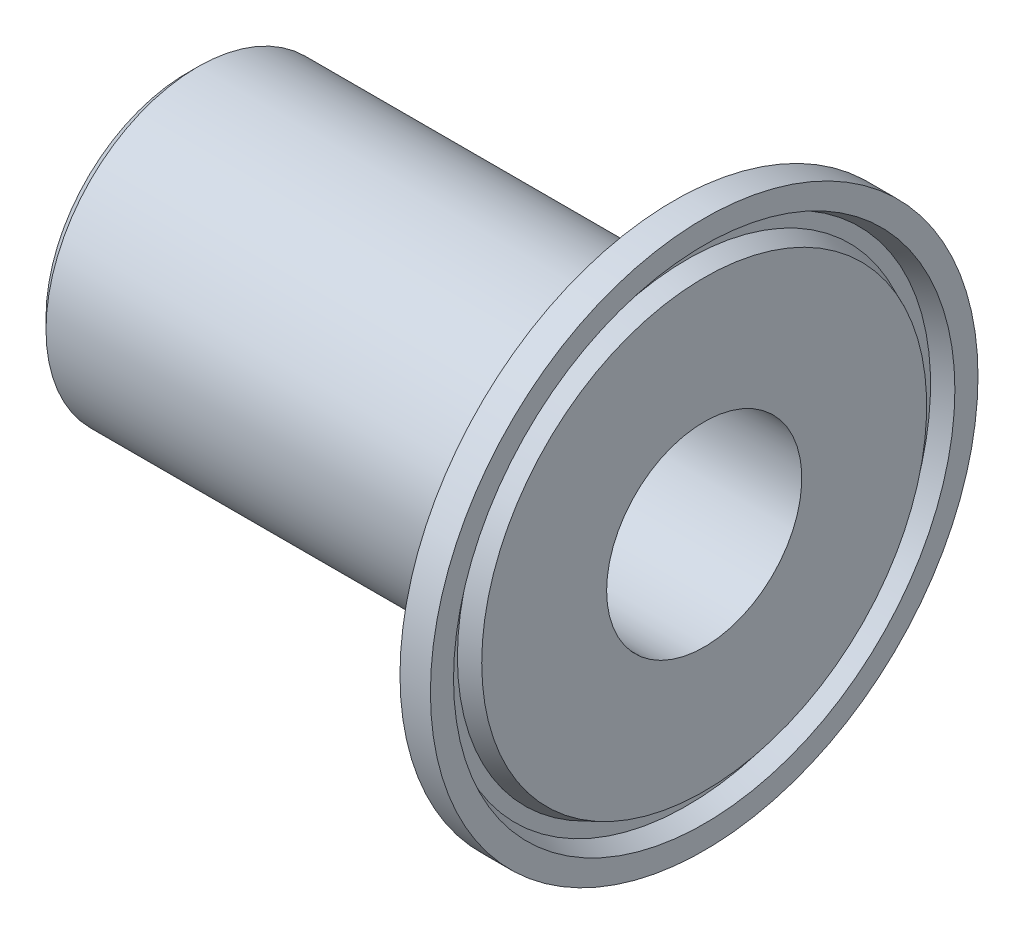
ISO-10303-21;
HEADER;
FILE_DESCRIPTION(('STEP AP214'),'2;1');
FILE_NAME('part.step','',(''),(''),'','','');
FILE_SCHEMA(('AUTOMOTIVE_DESIGN { 1 0 10303 214 1 1 1 1 }'));
ENDSEC;
DATA;
#1=APPLICATION_CONTEXT('core data for automotive mechanical design processes');
#2=APPLICATION_PROTOCOL_DEFINITION('international standard','automotive_design',2000,#1);
#3=PRODUCT_CONTEXT('',#1,'mechanical');
#4=PRODUCT('Part','Part','',(#3));
#5=PRODUCT_RELATED_PRODUCT_CATEGORY('part','',(#4));
#6=PRODUCT_DEFINITION_FORMATION('','',#4);
#7=PRODUCT_DEFINITION_CONTEXT('part definition',#1,'design');
#8=PRODUCT_DEFINITION('design','',#6,#7);
#9=PRODUCT_DEFINITION_SHAPE('','',#8);
#10=(LENGTH_UNIT() NAMED_UNIT(*) SI_UNIT(.MILLI.,.METRE.));
#11=(NAMED_UNIT(*) PLANE_ANGLE_UNIT() SI_UNIT($,.RADIAN.));
#12=(NAMED_UNIT(*) SI_UNIT($,.STERADIAN.) SOLID_ANGLE_UNIT());
#13=UNCERTAINTY_MEASURE_WITH_UNIT(LENGTH_MEASURE(1.E-05),#10,'distance_accuracy_value','');
#14=(GEOMETRIC_REPRESENTATION_CONTEXT(3) GLOBAL_UNCERTAINTY_ASSIGNED_CONTEXT((#13)) GLOBAL_UNIT_ASSIGNED_CONTEXT((#10,
#11,#12)) REPRESENTATION_CONTEXT('',''));
#15=CARTESIAN_POINT('',(0.,0.,0.));
#16=DIRECTION('',(0.,0.,1.));
#17=DIRECTION('',(1.,0.,0.));
#18=AXIS2_PLACEMENT_3D('',#15,#16,#17);
#19=CARTESIAN_POINT('',(47.7017023516684,20.5186,0.));
#20=DIRECTION('',(-1.,0.,0.));
#21=DIRECTION('',(0.,0.,1.));
#22=AXIS2_PLACEMENT_3D('',#19,#20,#21);
#23=PLANE('',#22);
#24=CARTESIAN_POINT('',(47.7017023516684,0.,0.));
#25=DIRECTION('',(-1.,0.,0.));
#26=DIRECTION('',(0.,0.,1.));
#27=AXIS2_PLACEMENT_3D('',#24,#25,#26);
#28=CIRCLE('',#27,20.5186);
#29=CARTESIAN_POINT('',(47.7017023516684,0.,20.5186));
#30=VERTEX_POINT('',#29);
#31=EDGE_CURVE('E45',#30,#30,#28,.T.);
#32=ORIENTED_EDGE('',*,*,#31,.F.);
#33=EDGE_LOOP('',(#32));
#34=FACE_BOUND('',#33,.T.);
#35=CARTESIAN_POINT('',(47.7017023516684,0.,0.));
#36=DIRECTION('',(-1.,0.,0.));
#37=DIRECTION('',(0.,0.,1.));
#38=AXIS2_PLACEMENT_3D('',#35,#36,#37);
#39=CIRCLE('',#38,9.);
#40=CARTESIAN_POINT('',(47.7017023516684,0.,9.));
#41=VERTEX_POINT('',#40);
#42=EDGE_CURVE('E75',#41,#41,#39,.T.);
#43=ORIENTED_EDGE('',*,*,#42,.T.);
#44=EDGE_LOOP('',(#43));
#45=FACE_BOUND('',#44,.T.);
#46=ADVANCED_FACE('F33',(#34,#45),#23,.F.);
#47=CARTESIAN_POINT('',(47.7017023516684,0.,0.));
#48=DIRECTION('',(-1.,0.,0.));
#49=DIRECTION('',(0.,0.,1.));
#50=AXIS2_PLACEMENT_3D('',#47,#48,#49);
#51=CONICAL_SURFACE('',#50,20.5186,0.401425727958694);
#52=CARTESIAN_POINT('',(46.1269023516684,0.,0.));
#53=DIRECTION('',(-1.,0.,0.));
#54=DIRECTION('',(0.,0.,1.));
#55=AXIS2_PLACEMENT_3D('',#52,#53,#54);
#56=CIRCLE('',#55,21.1870629405669);
#57=CARTESIAN_POINT('',(46.1269023516684,0.,21.1870629405669));
#58=VERTEX_POINT('',#57);
#59=EDGE_CURVE('E49',#58,#58,#56,.T.);
#60=ORIENTED_EDGE('',*,*,#59,.F.);
#61=EDGE_LOOP('',(#60));
#62=FACE_BOUND('',#61,.T.);
#63=ORIENTED_EDGE('',*,*,#31,.T.);
#64=EDGE_LOOP('',(#63));
#65=FACE_BOUND('',#64,.T.);
#66=ADVANCED_FACE('F96',(#62,#65),#51,.T.);
#67=CARTESIAN_POINT('',(46.1269023516684,22.4501370594331,0.));
#68=DIRECTION('',(-1.,0.,0.));
#69=DIRECTION('',(0.,0.,1.));
#70=AXIS2_PLACEMENT_3D('',#67,#68,#69);
#71=PLANE('',#70);
#72=CARTESIAN_POINT('',(46.1269023516684,0.,0.));
#73=DIRECTION('',(-1.,0.,0.));
#74=DIRECTION('',(0.,0.,1.));
#75=AXIS2_PLACEMENT_3D('',#72,#73,#74);
#76=CIRCLE('',#75,22.4501370594331);
#77=CARTESIAN_POINT('',(46.1269023516684,0.,22.4501370594331));
#78=VERTEX_POINT('',#77);
#79=EDGE_CURVE('E54',#78,#78,#76,.T.);
#80=ORIENTED_EDGE('',*,*,#79,.F.);
#81=EDGE_LOOP('',(#80));
#82=FACE_BOUND('',#81,.T.);
#83=ORIENTED_EDGE('',*,*,#59,.T.);
#84=EDGE_LOOP('',(#83));
#85=FACE_BOUND('',#84,.T.);
#86=ADVANCED_FACE('F101',(#82,#85),#71,.F.);
#87=CARTESIAN_POINT('',(46.1269023516684,0.,0.));
#88=DIRECTION('',(1.,0.,0.));
#89=DIRECTION('',(0.,0.,-1.));
#90=AXIS2_PLACEMENT_3D('',#87,#88,#89);
#91=CONICAL_SURFACE('',#90,22.4501370594331,0.401425727958694);
#92=CARTESIAN_POINT('',(47.7017023516684,0.,0.));
#93=DIRECTION('',(-1.,0.,0.));
#94=DIRECTION('',(0.,0.,1.));
#95=AXIS2_PLACEMENT_3D('',#92,#93,#94);
#96=CIRCLE('',#95,23.1186);
#97=CARTESIAN_POINT('',(47.7017023516684,0.,23.1186));
#98=VERTEX_POINT('',#97);
#99=EDGE_CURVE('E57',#98,#98,#96,.T.);
#100=ORIENTED_EDGE('',*,*,#99,.F.);
#101=EDGE_LOOP('',(#100));
#102=FACE_BOUND('',#101,.T.);
#103=ORIENTED_EDGE('',*,*,#79,.T.);
#104=EDGE_LOOP('',(#103));
#105=FACE_BOUND('',#104,.T.);
#106=ADVANCED_FACE('F108',(#102,#105),#91,.F.);
#107=CARTESIAN_POINT('',(47.7017023516684,25.25,0.));
#108=DIRECTION('',(-1.,0.,0.));
#109=DIRECTION('',(0.,0.,1.));
#110=AXIS2_PLACEMENT_3D('',#107,#108,#109);
#111=PLANE('',#110);
#112=CARTESIAN_POINT('',(47.7017023516684,0.,0.));
#113=DIRECTION('',(-1.,0.,0.));
#114=DIRECTION('',(0.,0.,1.));
#115=AXIS2_PLACEMENT_3D('',#112,#113,#114);
#116=CIRCLE('',#115,25.25);
#117=CARTESIAN_POINT('',(47.7017023516684,0.,25.25));
#118=VERTEX_POINT('',#117);
#119=EDGE_CURVE('E60',#118,#118,#116,.T.);
#120=ORIENTED_EDGE('',*,*,#119,.F.);
#121=EDGE_LOOP('',(#120));
#122=FACE_BOUND('',#121,.T.);
#123=ORIENTED_EDGE('',*,*,#99,.T.);
#124=EDGE_LOOP('',(#123));
#125=FACE_BOUND('',#124,.T.);
#126=ADVANCED_FACE('F112',(#122,#125),#111,.F.);
#127=CARTESIAN_POINT('',(0.,0.,0.));
#128=DIRECTION('',(-1.,0.,0.));
#129=DIRECTION('',(0.,0.,1.));
#130=AXIS2_PLACEMENT_3D('',#127,#128,#129);
#131=CYLINDRICAL_SURFACE('',#130,25.25);
#132=CARTESIAN_POINT('',(44.8950023516684,0.,0.));
#133=DIRECTION('',(-1.,0.,0.));
#134=DIRECTION('',(0.,0.,1.));
#135=AXIS2_PLACEMENT_3D('',#132,#133,#134);
#136=CIRCLE('',#135,25.25);
#137=CARTESIAN_POINT('',(44.8950023516684,0.,25.25));
#138=VERTEX_POINT('',#137);
#139=EDGE_CURVE('E63',#138,#138,#136,.T.);
#140=ORIENTED_EDGE('',*,*,#139,.F.);
#141=EDGE_LOOP('',(#140));
#142=FACE_BOUND('',#141,.T.);
#143=ORIENTED_EDGE('',*,*,#119,.T.);
#144=EDGE_LOOP('',(#143));
#145=FACE_BOUND('',#144,.T.);
#146=ADVANCED_FACE('F116',(#142,#145),#131,.T.);
#147=CARTESIAN_POINT('',(44.8950023516684,0.,0.));
#148=DIRECTION('',(1.,0.,0.));
#149=DIRECTION('',(0.,0.,-1.));
#150=AXIS2_PLACEMENT_3D('',#147,#148,#149);
#151=CONICAL_SURFACE('',#150,25.25,1.22173047639604);
#152=CARTESIAN_POINT('',(41.0740686655583,0.,0.));
#153=DIRECTION('',(-1.,0.,0.));
#154=DIRECTION('',(0.,0.,1.));
#155=AXIS2_PLACEMENT_3D('',#152,#153,#154);
#156=CIRCLE('',#155,14.7520709761788);
#157=CARTESIAN_POINT('',(41.0740686655583,0.,14.7520709761788));
#158=VERTEX_POINT('',#157);
#159=EDGE_CURVE('E66',#158,#158,#156,.T.);
#160=ORIENTED_EDGE('',*,*,#159,.F.);
#161=EDGE_LOOP('',(#160));
#162=FACE_BOUND('',#161,.T.);
#163=ORIENTED_EDGE('',*,*,#139,.T.);
#164=EDGE_LOOP('',(#163));
#165=FACE_BOUND('',#164,.T.);
#166=ADVANCED_FACE('F120',(#162,#165),#151,.T.);
#167=CARTESIAN_POINT('',(40.,0.,0.));
#168=DIRECTION('',(-1.,0.,0.));
#169=DIRECTION('',(0.,0.,1.));
#170=AXIS2_PLACEMENT_3D('',#167,#168,#169);
#171=TOROIDAL_SURFACE('',#170,15.143,1.143);
#172=CARTESIAN_POINT('',(40.,0.,0.));
#173=DIRECTION('',(-1.,0.,0.));
#174=DIRECTION('',(0.,0.,1.));
#175=AXIS2_PLACEMENT_3D('',#172,#173,#174);
#176=CIRCLE('',#175,14.);
#177=CARTESIAN_POINT('',(40.,0.,14.));
#178=VERTEX_POINT('',#177);
#179=EDGE_CURVE('E69',#178,#178,#176,.T.);
#180=ORIENTED_EDGE('',*,*,#179,.F.);
#181=EDGE_LOOP('',(#180));
#182=FACE_BOUND('',#181,.T.);
#183=ORIENTED_EDGE('',*,*,#159,.T.);
#184=EDGE_LOOP('',(#183));
#185=FACE_BOUND('',#184,.T.);
#186=ADVANCED_FACE('F93',(#182,#185),#171,.F.);
#187=CARTESIAN_POINT('',(0.,0.,0.));
#188=DIRECTION('',(-1.,0.,0.));
#189=DIRECTION('',(0.,0.,1.));
#190=AXIS2_PLACEMENT_3D('',#187,#188,#189);
#191=CYLINDRICAL_SURFACE('',#190,14.);
#192=CARTESIAN_POINT('',(1.00000000000001,0.,0.));
#193=DIRECTION('',(1.,0.,0.));
#194=DIRECTION('',(0.,0.,-1.));
#195=AXIS2_PLACEMENT_3D('',#192,#193,#194);
#196=CIRCLE('',#195,14.);
#197=CARTESIAN_POINT('',(1.00000000000001,0.,-14.));
#198=VERTEX_POINT('',#197);
#199=EDGE_CURVE('E10',#198,#198,#196,.T.);
#200=ORIENTED_EDGE('',*,*,#199,.T.);
#201=EDGE_LOOP('',(#200));
#202=FACE_BOUND('',#201,.T.);
#203=ORIENTED_EDGE('',*,*,#179,.T.);
#204=EDGE_LOOP('',(#203));
#205=FACE_BOUND('',#204,.T.);
#206=ADVANCED_FACE('F88',(#202,#205),#191,.T.);
#207=CARTESIAN_POINT('',(0.,14.,0.));
#208=DIRECTION('',(1.,0.,0.));
#209=DIRECTION('',(0.,0.,-1.));
#210=AXIS2_PLACEMENT_3D('',#207,#208,#209);
#211=PLANE('',#210);
#212=CARTESIAN_POINT('',(0.,0.,0.));
#213=DIRECTION('',(1.,0.,0.));
#214=DIRECTION('',(0.,0.,-1.));
#215=AXIS2_PLACEMENT_3D('',#212,#213,#214);
#216=CIRCLE('',#215,13.);
#217=CARTESIAN_POINT('',(0.,0.,-13.));
#218=VERTEX_POINT('',#217);
#219=EDGE_CURVE('E41',#218,#218,#216,.F.);
#220=ORIENTED_EDGE('',*,*,#219,.T.);
#221=EDGE_LOOP('',(#220));
#222=FACE_BOUND('',#221,.T.);
#223=CARTESIAN_POINT('',(0.,0.,0.));
#224=DIRECTION('',(-1.,0.,0.));
#225=DIRECTION('',(0.,0.,1.));
#226=AXIS2_PLACEMENT_3D('',#223,#224,#225);
#227=CIRCLE('',#226,8.99999999999999);
#228=CARTESIAN_POINT('',(0.,0.,8.99999999999999));
#229=VERTEX_POINT('',#228);
#230=EDGE_CURVE('E72',#229,#229,#227,.T.);
#231=ORIENTED_EDGE('',*,*,#230,.F.);
#232=EDGE_LOOP('',(#231));
#233=FACE_BOUND('',#232,.T.);
#234=ADVANCED_FACE('F83',(#222,#233),#211,.F.);
#235=CARTESIAN_POINT('',(0.,0.,0.));
#236=DIRECTION('',(-1.,0.,0.));
#237=DIRECTION('',(0.,0.,1.));
#238=AXIS2_PLACEMENT_3D('',#235,#236,#237);
#239=CYLINDRICAL_SURFACE('',#238,9.);
#240=ORIENTED_EDGE('',*,*,#42,.F.);
#241=EDGE_LOOP('',(#240));
#242=FACE_BOUND('',#241,.T.);
#243=ORIENTED_EDGE('',*,*,#230,.T.);
#244=EDGE_LOOP('',(#243));
#245=FACE_BOUND('',#244,.T.);
#246=ADVANCED_FACE('F80',(#242,#245),#239,.F.);
#247=CARTESIAN_POINT('',(0.,0.,0.));
#248=DIRECTION('',(1.,0.,0.));
#249=DIRECTION('',(0.,0.,-1.));
#250=AXIS2_PLACEMENT_3D('',#247,#248,#249);
#251=CONICAL_SURFACE('',#250,13.,0.785398163397448);
#252=ORIENTED_EDGE('',*,*,#199,.F.);
#253=EDGE_LOOP('',(#252));
#254=FACE_BOUND('',#253,.T.);
#255=ORIENTED_EDGE('',*,*,#219,.F.);
#256=EDGE_LOOP('',(#255));
#257=FACE_BOUND('',#256,.T.);
#258=ADVANCED_FACE('F36',(#254,#257),#251,.T.);
#259=CLOSED_SHELL('',(#46,#66,#86,#106,#126,#146,#166,#186,#206,#234,#246,#258));
#260=MANIFOLD_SOLID_BREP('B2',#259);
#261=ADVANCED_BREP_SHAPE_REPRESENTATION('',(#18,#260),#14);
#262=SHAPE_DEFINITION_REPRESENTATION(#9,#261);
ENDSEC;
END-ISO-10303-21;
